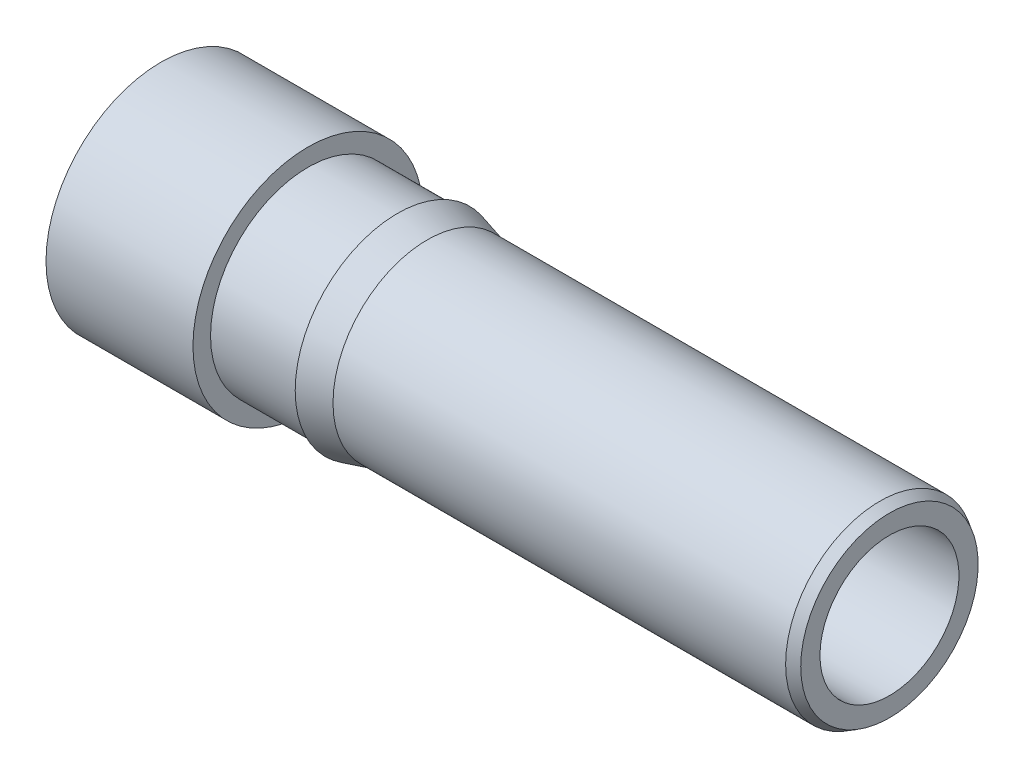
ISO-10303-21;
HEADER;
FILE_DESCRIPTION(('STEP AP214'),'2;1');
FILE_NAME('part.step','',(''),(''),'','','');
FILE_SCHEMA(('AUTOMOTIVE_DESIGN { 1 0 10303 214 1 1 1 1 }'));
ENDSEC;
DATA;
#1=APPLICATION_CONTEXT('core data for automotive mechanical design processes');
#2=APPLICATION_PROTOCOL_DEFINITION('international standard','automotive_design',2000,#1);
#3=PRODUCT_CONTEXT('',#1,'mechanical');
#4=PRODUCT('Part','Part','',(#3));
#5=PRODUCT_RELATED_PRODUCT_CATEGORY('part','',(#4));
#6=PRODUCT_DEFINITION_FORMATION('','',#4);
#7=PRODUCT_DEFINITION_CONTEXT('part definition',#1,'design');
#8=PRODUCT_DEFINITION('design','',#6,#7);
#9=PRODUCT_DEFINITION_SHAPE('','',#8);
#10=(LENGTH_UNIT() NAMED_UNIT(*) SI_UNIT(.MILLI.,.METRE.));
#11=(NAMED_UNIT(*) PLANE_ANGLE_UNIT() SI_UNIT($,.RADIAN.));
#12=(NAMED_UNIT(*) SI_UNIT($,.STERADIAN.) SOLID_ANGLE_UNIT());
#13=UNCERTAINTY_MEASURE_WITH_UNIT(LENGTH_MEASURE(1.E-05),#10,'distance_accuracy_value','');
#14=(GEOMETRIC_REPRESENTATION_CONTEXT(3) GLOBAL_UNCERTAINTY_ASSIGNED_CONTEXT((#13)) GLOBAL_UNIT_ASSIGNED_CONTEXT((#10,
#11,#12)) REPRESENTATION_CONTEXT('',''));
#15=CARTESIAN_POINT('',(0.,0.,0.));
#16=DIRECTION('',(0.,0.,1.));
#17=DIRECTION('',(1.,0.,0.));
#18=AXIS2_PLACEMENT_3D('',#15,#16,#17);
#19=CARTESIAN_POINT('',(5.79120000000002,0.705305909487725,0.));
#20=DIRECTION('',(-1.,0.,0.));
#21=DIRECTION('',(0.,0.,1.));
#22=AXIS2_PLACEMENT_3D('',#19,#20,#21);
#23=PLANE('',#22);
#24=CARTESIAN_POINT('',(5.79120000000004,0.,0.));
#25=DIRECTION('',(-1.,0.,0.));
#26=DIRECTION('',(0.,0.,1.));
#27=AXIS2_PLACEMENT_3D('',#24,#25,#26);
#28=CIRCLE('',#27,0.552449999999998);
#29=CARTESIAN_POINT('',(5.79120000000004,0.,0.552449999999998));
#30=VERTEX_POINT('',#29);
#31=EDGE_CURVE('E68',#30,#30,#28,.T.);
#32=ORIENTED_EDGE('',*,*,#31,.T.);
#33=EDGE_LOOP('',(#32));
#34=FACE_BOUND('',#33,.T.);
#35=CARTESIAN_POINT('',(5.79120000000001,0.,0.));
#36=DIRECTION('',(-1.,0.,0.));
#37=DIRECTION('',(0.,0.,1.));
#38=AXIS2_PLACEMENT_3D('',#35,#36,#37);
#39=CIRCLE('',#38,0.705305909487725);
#40=CARTESIAN_POINT('',(5.79120000000001,0.,0.705305909487725));
#41=VERTEX_POINT('',#40);
#42=EDGE_CURVE('E10',#41,#41,#39,.T.);
#43=ORIENTED_EDGE('',*,*,#42,.F.);
#44=EDGE_LOOP('',(#43));
#45=FACE_BOUND('',#44,.T.);
#46=ADVANCED_FACE('F31',(#34,#45),#23,.F.);
#47=CARTESIAN_POINT('',(5.79120000000001,0.,0.));
#48=DIRECTION('',(-1.,0.,0.));
#49=DIRECTION('',(0.,0.,1.));
#50=AXIS2_PLACEMENT_3D('',#47,#48,#49);
#51=CONICAL_SURFACE('',#50,0.705305909487725,0.523598775598293);
#52=CARTESIAN_POINT('',(5.715,0.,0.));
#53=DIRECTION('',(-1.,0.,0.));
#54=DIRECTION('',(0.,0.,1.));
#55=AXIS2_PLACEMENT_3D('',#52,#53,#54);
#56=CIRCLE('',#55,0.749299999999981);
#57=CARTESIAN_POINT('',(5.715,0.,0.749299999999981));
#58=VERTEX_POINT('',#57);
#59=EDGE_CURVE('E38',#58,#58,#56,.T.);
#60=ORIENTED_EDGE('',*,*,#59,.F.);
#61=EDGE_LOOP('',(#60));
#62=FACE_BOUND('',#61,.T.);
#63=ORIENTED_EDGE('',*,*,#42,.T.);
#64=EDGE_LOOP('',(#63));
#65=FACE_BOUND('',#64,.T.);
#66=ADVANCED_FACE('F88',(#62,#65),#51,.T.);
#67=CARTESIAN_POINT('',(0.,0.,0.));
#68=DIRECTION('',(-1.,0.,0.));
#69=DIRECTION('',(0.,0.,1.));
#70=AXIS2_PLACEMENT_3D('',#67,#68,#69);
#71=CYLINDRICAL_SURFACE('',#70,0.749299999999981);
#72=CARTESIAN_POINT('',(2.11658522628074,0.,0.));
#73=DIRECTION('',(-1.,0.,0.));
#74=DIRECTION('',(0.,0.,1.));
#75=AXIS2_PLACEMENT_3D('',#72,#73,#74);
#76=CIRCLE('',#75,0.749299999999981);
#77=CARTESIAN_POINT('',(2.11658522628074,0.,0.749299999999981));
#78=VERTEX_POINT('',#77);
#79=EDGE_CURVE('E42',#78,#78,#76,.T.);
#80=ORIENTED_EDGE('',*,*,#79,.F.);
#81=EDGE_LOOP('',(#80));
#82=FACE_BOUND('',#81,.T.);
#83=ORIENTED_EDGE('',*,*,#59,.T.);
#84=EDGE_LOOP('',(#83));
#85=FACE_BOUND('',#84,.T.);
#86=ADVANCED_FACE('F92',(#82,#85),#71,.T.);
#87=CARTESIAN_POINT('',(2.11658522628074,0.,0.));
#88=DIRECTION('',(-1.,0.,0.));
#89=DIRECTION('',(0.,0.,1.));
#90=AXIS2_PLACEMENT_3D('',#87,#88,#89);
#91=CONICAL_SURFACE('',#90,0.749299999999981,0.261799387799215);
#92=CARTESIAN_POINT('',(1.8796,0.,0.));
#93=DIRECTION('',(-1.,0.,0.));
#94=DIRECTION('',(0.,0.,1.));
#95=AXIS2_PLACEMENT_3D('',#92,#93,#94);
#96=CIRCLE('',#95,0.81280000000003);
#97=CARTESIAN_POINT('',(1.8796,0.,0.81280000000003));
#98=VERTEX_POINT('',#97);
#99=EDGE_CURVE('E47',#98,#98,#96,.T.);
#100=ORIENTED_EDGE('',*,*,#99,.F.);
#101=EDGE_LOOP('',(#100));
#102=FACE_BOUND('',#101,.T.);
#103=ORIENTED_EDGE('',*,*,#79,.T.);
#104=EDGE_LOOP('',(#103));
#105=FACE_BOUND('',#104,.T.);
#106=ADVANCED_FACE('F98',(#102,#105),#91,.T.);
#107=CARTESIAN_POINT('',(1.8796,0.774699999999989,0.));
#108=DIRECTION('',(1.,0.,0.));
#109=DIRECTION('',(0.,0.,-1.));
#110=AXIS2_PLACEMENT_3D('',#107,#108,#109);
#111=PLANE('',#110);
#112=CARTESIAN_POINT('',(1.8796,0.,0.));
#113=DIRECTION('',(-1.,0.,0.));
#114=DIRECTION('',(0.,0.,1.));
#115=AXIS2_PLACEMENT_3D('',#112,#113,#114);
#116=CIRCLE('',#115,0.774699999999989);
#117=CARTESIAN_POINT('',(1.8796,0.,0.774699999999989));
#118=VERTEX_POINT('',#117);
#119=EDGE_CURVE('E50',#118,#118,#116,.T.);
#120=ORIENTED_EDGE('',*,*,#119,.F.);
#121=EDGE_LOOP('',(#120));
#122=FACE_BOUND('',#121,.T.);
#123=ORIENTED_EDGE('',*,*,#99,.T.);
#124=EDGE_LOOP('',(#123));
#125=FACE_BOUND('',#124,.T.);
#126=ADVANCED_FACE('F105',(#122,#125),#111,.F.);
#127=CARTESIAN_POINT('',(0.,0.,0.));
#128=DIRECTION('',(-1.,0.,0.));
#129=DIRECTION('',(0.,0.,1.));
#130=AXIS2_PLACEMENT_3D('',#127,#128,#129);
#131=CYLINDRICAL_SURFACE('',#130,0.774699999999989);
#132=CARTESIAN_POINT('',(1.16840000000004,0.,0.));
#133=DIRECTION('',(-1.,0.,0.));
#134=DIRECTION('',(0.,0.,1.));
#135=AXIS2_PLACEMENT_3D('',#132,#133,#134);
#136=CIRCLE('',#135,0.774699999999989);
#137=CARTESIAN_POINT('',(1.16840000000004,0.,0.774699999999989));
#138=VERTEX_POINT('',#137);
#139=EDGE_CURVE('E53',#138,#138,#136,.T.);
#140=ORIENTED_EDGE('',*,*,#139,.F.);
#141=EDGE_LOOP('',(#140));
#142=FACE_BOUND('',#141,.T.);
#143=ORIENTED_EDGE('',*,*,#119,.T.);
#144=EDGE_LOOP('',(#143));
#145=FACE_BOUND('',#144,.T.);
#146=ADVANCED_FACE('F109',(#142,#145),#131,.T.);
#147=CARTESIAN_POINT('',(1.16840000000004,0.914399999999982,0.));
#148=DIRECTION('',(-1.,0.,0.));
#149=DIRECTION('',(0.,0.,1.));
#150=AXIS2_PLACEMENT_3D('',#147,#148,#149);
#151=PLANE('',#150);
#152=CARTESIAN_POINT('',(1.16840000000004,0.,0.));
#153=DIRECTION('',(-1.,0.,0.));
#154=DIRECTION('',(0.,0.,1.));
#155=AXIS2_PLACEMENT_3D('',#152,#153,#154);
#156=CIRCLE('',#155,0.914399999999982);
#157=CARTESIAN_POINT('',(1.16840000000004,0.,0.914399999999982));
#158=VERTEX_POINT('',#157);
#159=EDGE_CURVE('E56',#158,#158,#156,.T.);
#160=ORIENTED_EDGE('',*,*,#159,.F.);
#161=EDGE_LOOP('',(#160));
#162=FACE_BOUND('',#161,.T.);
#163=ORIENTED_EDGE('',*,*,#139,.T.);
#164=EDGE_LOOP('',(#163));
#165=FACE_BOUND('',#164,.T.);
#166=ADVANCED_FACE('F113',(#162,#165),#151,.F.);
#167=CARTESIAN_POINT('',(0.,0.,0.));
#168=DIRECTION('',(-1.,0.,0.));
#169=DIRECTION('',(0.,0.,1.));
#170=AXIS2_PLACEMENT_3D('',#167,#168,#169);
#171=CYLINDRICAL_SURFACE('',#170,0.914399999999982);
#172=CARTESIAN_POINT('',(0.,0.,0.));
#173=DIRECTION('',(-1.,0.,0.));
#174=DIRECTION('',(0.,0.,1.));
#175=AXIS2_PLACEMENT_3D('',#172,#173,#174);
#176=CIRCLE('',#175,0.914399999999982);
#177=CARTESIAN_POINT('',(0.,0.,0.914399999999982));
#178=VERTEX_POINT('',#177);
#179=EDGE_CURVE('E59',#178,#178,#176,.T.);
#180=ORIENTED_EDGE('',*,*,#179,.F.);
#181=EDGE_LOOP('',(#180));
#182=FACE_BOUND('',#181,.T.);
#183=ORIENTED_EDGE('',*,*,#159,.T.);
#184=EDGE_LOOP('',(#183));
#185=FACE_BOUND('',#184,.T.);
#186=ADVANCED_FACE('F117',(#182,#185),#171,.T.);
#187=CARTESIAN_POINT('',(0.,0.,0.));
#188=DIRECTION('',(1.,0.,0.));
#189=DIRECTION('',(0.,0.,-1.));
#190=AXIS2_PLACEMENT_3D('',#187,#188,#189);
#191=PLANE('',#190);
#192=CARTESIAN_POINT('',(0.,0.,0.));
#193=DIRECTION('',(-1.,0.,0.));
#194=DIRECTION('',(0.,0.,1.));
#195=AXIS2_PLACEMENT_3D('',#192,#193,#194);
#196=CIRCLE('',#195,0.647699999999999);
#197=CARTESIAN_POINT('',(0.,0.,0.647699999999999));
#198=VERTEX_POINT('',#197);
#199=EDGE_CURVE('E62',#198,#198,#196,.T.);
#200=ORIENTED_EDGE('',*,*,#199,.F.);
#201=EDGE_LOOP('',(#200));
#202=FACE_BOUND('',#201,.T.);
#203=ORIENTED_EDGE('',*,*,#179,.T.);
#204=EDGE_LOOP('',(#203));
#205=FACE_BOUND('',#204,.T.);
#206=ADVANCED_FACE('F121',(#202,#205),#191,.F.);
#207=CARTESIAN_POINT('',(0.,0.,0.));
#208=DIRECTION('',(-1.,0.,0.));
#209=DIRECTION('',(0.,0.,1.));
#210=AXIS2_PLACEMENT_3D('',#207,#208,#209);
#211=CYLINDRICAL_SURFACE('',#210,0.647699999999999);
#212=CARTESIAN_POINT('',(3.0226,0.,0.));
#213=DIRECTION('',(-1.,0.,0.));
#214=DIRECTION('',(0.,0.,1.));
#215=AXIS2_PLACEMENT_3D('',#212,#213,#214);
#216=CIRCLE('',#215,0.647699999999999);
#217=CARTESIAN_POINT('',(3.0226,0.,0.647699999999999));
#218=VERTEX_POINT('',#217);
#219=EDGE_CURVE('E65',#218,#218,#216,.T.);
#220=ORIENTED_EDGE('',*,*,#219,.F.);
#221=EDGE_LOOP('',(#220));
#222=FACE_BOUND('',#221,.T.);
#223=ORIENTED_EDGE('',*,*,#199,.T.);
#224=EDGE_LOOP('',(#223));
#225=FACE_BOUND('',#224,.T.);
#226=ADVANCED_FACE('F85',(#222,#225),#211,.F.);
#227=CARTESIAN_POINT('',(3.0226,0.,0.));
#228=DIRECTION('',(-1.,0.,0.));
#229=DIRECTION('',(0.,0.,1.));
#230=AXIS2_PLACEMENT_3D('',#227,#228,#229);
#231=CONICAL_SURFACE('',#230,0.647699999999999,1.02974425867666);
#232=CARTESIAN_POINT('',(3.07983197396238,0.,0.));
#233=DIRECTION('',(-1.,0.,0.));
#234=DIRECTION('',(0.,0.,1.));
#235=AXIS2_PLACEMENT_3D('',#232,#233,#234);
#236=CIRCLE('',#235,0.552449999999999);
#237=CARTESIAN_POINT('',(3.07983197396238,0.,0.552449999999999));
#238=VERTEX_POINT('',#237);
#239=EDGE_CURVE('E34',#238,#238,#236,.F.);
#240=ORIENTED_EDGE('',*,*,#239,.T.);
#241=EDGE_LOOP('',(#240));
#242=FACE_BOUND('',#241,.T.);
#243=ORIENTED_EDGE('',*,*,#219,.T.);
#244=EDGE_LOOP('',(#243));
#245=FACE_BOUND('',#244,.T.);
#246=ADVANCED_FACE('F75',(#242,#245),#231,.F.);
#247=CARTESIAN_POINT('',(0.,0.,0.));
#248=DIRECTION('',(-1.,0.,0.));
#249=DIRECTION('',(0.,0.,1.));
#250=AXIS2_PLACEMENT_3D('',#247,#248,#249);
#251=CYLINDRICAL_SURFACE('',#250,0.552449999999999);
#252=ORIENTED_EDGE('',*,*,#31,.F.);
#253=EDGE_LOOP('',(#252));
#254=FACE_BOUND('',#253,.T.);
#255=ORIENTED_EDGE('',*,*,#239,.F.);
#256=EDGE_LOOP('',(#255));
#257=FACE_BOUND('',#256,.T.);
#258=ADVANCED_FACE('F78',(#254,#257),#251,.F.);
#259=CLOSED_SHELL('',(#46,#66,#86,#106,#126,#146,#166,#186,#206,#226,#246,#258));
#260=MANIFOLD_SOLID_BREP('B2',#259);
#261=ADVANCED_BREP_SHAPE_REPRESENTATION('',(#18,#260),#14);
#262=SHAPE_DEFINITION_REPRESENTATION(#9,#261);
ENDSEC;
END-ISO-10303-21;
